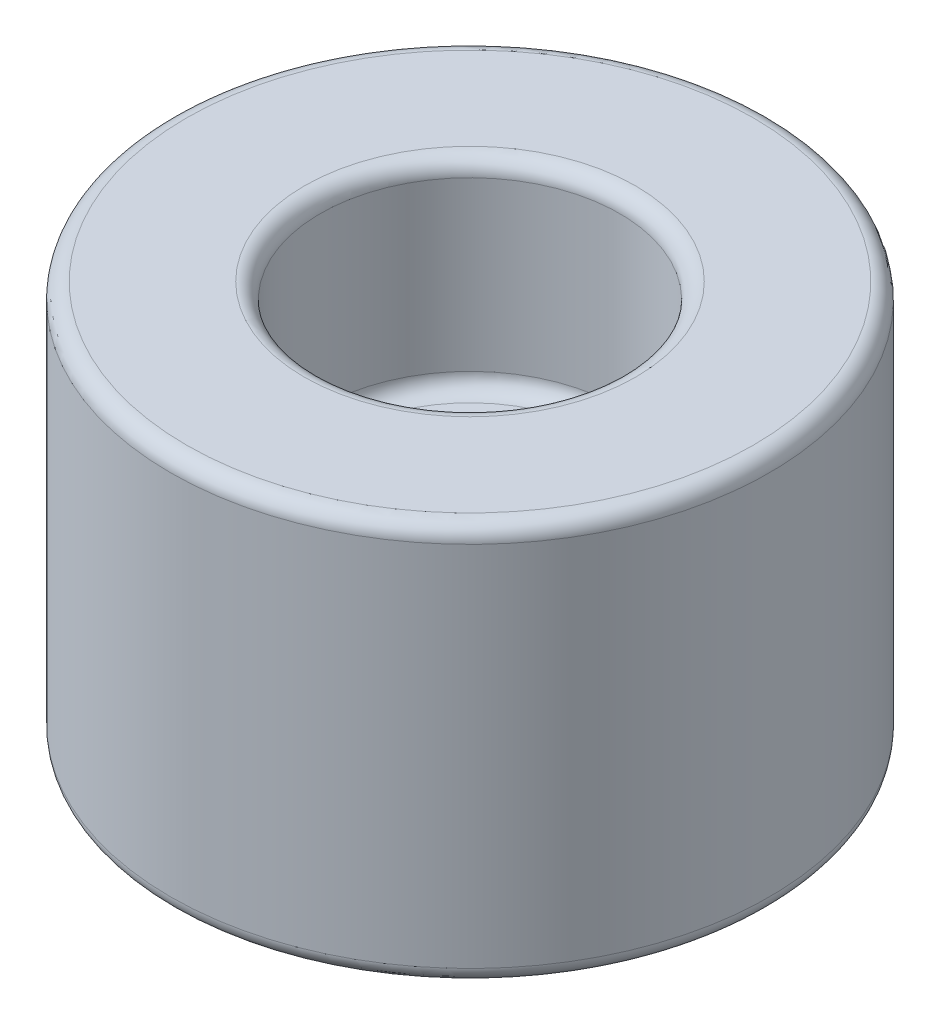
ISO-10303-21;
HEADER;
FILE_DESCRIPTION(('STEP AP214'),'2;1');
FILE_NAME('part.step','',(''),(''),'','','');
FILE_SCHEMA(('AUTOMOTIVE_DESIGN { 1 0 10303 214 1 1 1 1 }'));
ENDSEC;
DATA;
#1=APPLICATION_CONTEXT('core data for automotive mechanical design processes');
#2=APPLICATION_PROTOCOL_DEFINITION('international standard','automotive_design',2000,#1);
#3=PRODUCT_CONTEXT('',#1,'mechanical');
#4=PRODUCT('Part','Part','',(#3));
#5=PRODUCT_RELATED_PRODUCT_CATEGORY('part','',(#4));
#6=PRODUCT_DEFINITION_FORMATION('','',#4);
#7=PRODUCT_DEFINITION_CONTEXT('part definition',#1,'design');
#8=PRODUCT_DEFINITION('design','',#6,#7);
#9=PRODUCT_DEFINITION_SHAPE('','',#8);
#10=(LENGTH_UNIT() NAMED_UNIT(*) SI_UNIT(.MILLI.,.METRE.));
#11=(NAMED_UNIT(*) PLANE_ANGLE_UNIT() SI_UNIT($,.RADIAN.));
#12=(NAMED_UNIT(*) SI_UNIT($,.STERADIAN.) SOLID_ANGLE_UNIT());
#13=UNCERTAINTY_MEASURE_WITH_UNIT(LENGTH_MEASURE(1.E-05),#10,'distance_accuracy_value','');
#14=(GEOMETRIC_REPRESENTATION_CONTEXT(3) GLOBAL_UNCERTAINTY_ASSIGNED_CONTEXT((#13)) GLOBAL_UNIT_ASSIGNED_CONTEXT((#10,
#11,#12)) REPRESENTATION_CONTEXT('',''));
#15=CARTESIAN_POINT('',(0.,0.,0.));
#16=DIRECTION('',(0.,0.,1.));
#17=DIRECTION('',(1.,0.,0.));
#18=AXIS2_PLACEMENT_3D('',#15,#16,#17);
#19=CARTESIAN_POINT('',(0.,0.,0.));
#20=DIRECTION('',(0.,-1.,0.));
#21=DIRECTION('',(0.,0.,-1.00000000000001));
#22=AXIS2_PLACEMENT_3D('',#19,#20,#21);
#23=CYLINDRICAL_SURFACE('',#22,4.7625);
#24=CARTESIAN_POINT('',(0.,6.85800000000034,0.));
#25=DIRECTION('',(0.,1.,0.));
#26=DIRECTION('',(0.,0.,1.00000000000001));
#27=AXIS2_PLACEMENT_3D('',#24,#25,#26);
#28=CIRCLE('',#27,4.7625);
#29=CARTESIAN_POINT('',(0.,6.85800000000035,4.76250000000003));
#30=VERTEX_POINT('',#29);
#31=EDGE_CURVE('E66',#30,#30,#28,.F.);
#32=ORIENTED_EDGE('',*,*,#31,.T.);
#33=EDGE_LOOP('',(#32));
#34=FACE_BOUND('',#33,.T.);
#35=CARTESIAN_POINT('',(0.,12.1920000000003,0.));
#36=DIRECTION('',(0.,1.,0.));
#37=DIRECTION('',(0.,0.,1.00000000000001));
#38=AXIS2_PLACEMENT_3D('',#35,#36,#37);
#39=CIRCLE('',#38,4.7625);
#40=CARTESIAN_POINT('',(0.,12.1920000000003,4.76250000000003));
#41=VERTEX_POINT('',#40);
#42=EDGE_CURVE('E69',#41,#41,#39,.T.);
#43=ORIENTED_EDGE('',*,*,#42,.T.);
#44=EDGE_LOOP('',(#43));
#45=FACE_BOUND('',#44,.T.);
#46=ADVANCED_FACE('F46',(#34,#45),#23,.F.);
#47=CARTESIAN_POINT('',(0.,12.6999999999999,-4.7625));
#48=DIRECTION('',(0.,1.,0.));
#49=DIRECTION('',(0.,0.,1.00000000000001));
#50=AXIS2_PLACEMENT_3D('',#47,#48,#49);
#51=PLANE('',#50);
#52=CARTESIAN_POINT('',(0.,12.7000000000003,0.));
#53=DIRECTION('',(0.,1.,0.));
#54=DIRECTION('',(0.,0.,1.00000000000001));
#55=AXIS2_PLACEMENT_3D('',#52,#53,#54);
#56=CIRCLE('',#55,5.2705);
#57=CARTESIAN_POINT('',(0.,12.7000000000003,5.27050000000003));
#58=VERTEX_POINT('',#57);
#59=EDGE_CURVE('E57',#58,#58,#56,.F.);
#60=ORIENTED_EDGE('',*,*,#59,.T.);
#61=EDGE_LOOP('',(#60));
#62=FACE_BOUND('',#61,.T.);
#63=CARTESIAN_POINT('',(0.,12.7000000000003,0.));
#64=DIRECTION('',(0.,1.,0.));
#65=DIRECTION('',(0.,0.,1.00000000000001));
#66=AXIS2_PLACEMENT_3D('',#63,#64,#65);
#67=CIRCLE('',#66,9.017);
#68=CARTESIAN_POINT('',(0.,12.7000000000003,9.01700000000006));
#69=VERTEX_POINT('',#68);
#70=EDGE_CURVE('E61',#69,#69,#67,.T.);
#71=ORIENTED_EDGE('',*,*,#70,.T.);
#72=EDGE_LOOP('',(#71));
#73=FACE_BOUND('',#72,.T.);
#74=ADVANCED_FACE('F115',(#62,#73),#51,.T.);
#75=CARTESIAN_POINT('',(0.,0.,0.));
#76=DIRECTION('',(0.,-1.,0.));
#77=DIRECTION('',(0.,0.,-1.00000000000001));
#78=AXIS2_PLACEMENT_3D('',#75,#76,#77);
#79=CYLINDRICAL_SURFACE('',#78,9.525);
#80=CARTESIAN_POINT('',(0.,0.507999999999842,0.));
#81=DIRECTION('',(0.,-1.,0.));
#82=DIRECTION('',(0.,0.,-1.00000000000001));
#83=AXIS2_PLACEMENT_3D('',#80,#81,#82);
#84=CIRCLE('',#83,9.525);
#85=CARTESIAN_POINT('',(0.,0.507999999999816,-9.52500000000007));
#86=VERTEX_POINT('',#85);
#87=EDGE_CURVE('E12',#86,#86,#84,.F.);
#88=ORIENTED_EDGE('',*,*,#87,.T.);
#89=EDGE_LOOP('',(#88));
#90=FACE_BOUND('',#89,.T.);
#91=CARTESIAN_POINT('',(0.,12.1920000000003,0.));
#92=DIRECTION('',(0.,1.,0.));
#93=DIRECTION('',(0.,0.,1.00000000000001));
#94=AXIS2_PLACEMENT_3D('',#91,#92,#93);
#95=CIRCLE('',#94,9.525);
#96=CARTESIAN_POINT('',(0.,12.1920000000003,9.52500000000007));
#97=VERTEX_POINT('',#96);
#98=EDGE_CURVE('E53',#97,#97,#95,.F.);
#99=ORIENTED_EDGE('',*,*,#98,.T.);
#100=EDGE_LOOP('',(#99));
#101=FACE_BOUND('',#100,.T.);
#102=ADVANCED_FACE('F127',(#90,#101),#79,.T.);
#103=CARTESIAN_POINT('',(0.,-1.66533453693773E-12,-9.52500000000001));
#104=DIRECTION('',(0.,-1.,0.));
#105=DIRECTION('',(0.,0.,-1.00000000000001));
#106=AXIS2_PLACEMENT_3D('',#103,#104,#105);
#107=PLANE('',#106);
#108=CARTESIAN_POINT('',(0.,0.,0.));
#109=DIRECTION('',(0.,-1.,0.));
#110=DIRECTION('',(0.,0.,-1.00000000000001));
#111=AXIS2_PLACEMENT_3D('',#108,#109,#110);
#112=CIRCLE('',#111,2.2939375);
#113=CARTESIAN_POINT('',(0.,0.,-2.29393750000002));
#114=VERTEX_POINT('',#113);
#115=EDGE_CURVE('E78',#114,#114,#112,.F.);
#116=ORIENTED_EDGE('',*,*,#115,.T.);
#117=EDGE_LOOP('',(#116));
#118=FACE_BOUND('',#117,.T.);
#119=CARTESIAN_POINT('',(0.,0.,0.));
#120=DIRECTION('',(0.,-1.,0.));
#121=DIRECTION('',(0.,0.,-1.00000000000001));
#122=AXIS2_PLACEMENT_3D('',#119,#120,#121);
#123=CIRCLE('',#122,9.017);
#124=CARTESIAN_POINT('',(0.,0.,-9.01700000000006));
#125=VERTEX_POINT('',#124);
#126=EDGE_CURVE('E81',#125,#125,#123,.T.);
#127=ORIENTED_EDGE('',*,*,#126,.T.);
#128=EDGE_LOOP('',(#127));
#129=FACE_BOUND('',#128,.T.);
#130=ADVANCED_FACE('F146',(#118,#129),#107,.T.);
#131=CARTESIAN_POINT('',(0.,0.,0.));
#132=DIRECTION('',(0.,-1.,0.));
#133=DIRECTION('',(0.,0.,-1.00000000000001));
#134=AXIS2_PLACEMENT_3D('',#131,#132,#133);
#135=CYLINDRICAL_SURFACE('',#134,1.7859375);
#136=CARTESIAN_POINT('',(0.,0.507999999999842,0.));
#137=DIRECTION('',(0.,-1.,0.));
#138=DIRECTION('',(0.,0.,-1.00000000000001));
#139=AXIS2_PLACEMENT_3D('',#136,#137,#138);
#140=CIRCLE('',#139,1.7859375);
#141=CARTESIAN_POINT('',(0.,0.507999999999837,-1.78593750000001));
#142=VERTEX_POINT('',#141);
#143=EDGE_CURVE('E84',#142,#142,#140,.T.);
#144=ORIENTED_EDGE('',*,*,#143,.T.);
#145=EDGE_LOOP('',(#144));
#146=FACE_BOUND('',#145,.T.);
#147=CARTESIAN_POINT('',(0.,5.8420000000001,0.));
#148=DIRECTION('',(0.,1.,0.));
#149=DIRECTION('',(0.,0.,1.00000000000001));
#150=AXIS2_PLACEMENT_3D('',#147,#148,#149);
#151=CIRCLE('',#150,1.7859375);
#152=CARTESIAN_POINT('',(0.,5.8420000000001,1.78593750000001));
#153=VERTEX_POINT('',#152);
#154=EDGE_CURVE('E87',#153,#153,#151,.T.);
#155=ORIENTED_EDGE('',*,*,#154,.T.);
#156=EDGE_LOOP('',(#155));
#157=FACE_BOUND('',#156,.T.);
#158=ADVANCED_FACE('F91',(#146,#157),#135,.F.);
#159=CARTESIAN_POINT('',(0.,6.34999999999837,-1.78593750000022));
#160=DIRECTION('',(0.,1.,0.));
#161=DIRECTION('',(0.,0.,1.00000000000001));
#162=AXIS2_PLACEMENT_3D('',#159,#160,#161);
#163=PLANE('',#162);
#164=CARTESIAN_POINT('',(0.,6.35000000000008,0.));
#165=DIRECTION('',(0.,1.,0.));
#166=DIRECTION('',(0.,0.,1.00000000000001));
#167=AXIS2_PLACEMENT_3D('',#164,#165,#166);
#168=CIRCLE('',#167,2.2939375);
#169=CARTESIAN_POINT('',(0.,6.35000000000008,2.29393750000002));
#170=VERTEX_POINT('',#169);
#171=EDGE_CURVE('E72',#170,#170,#168,.F.);
#172=ORIENTED_EDGE('',*,*,#171,.T.);
#173=EDGE_LOOP('',(#172));
#174=FACE_BOUND('',#173,.T.);
#175=CARTESIAN_POINT('',(0.,6.35000000000008,0.));
#176=DIRECTION('',(0.,1.,0.));
#177=DIRECTION('',(0.,0.,1.00000000000001));
#178=AXIS2_PLACEMENT_3D('',#175,#176,#177);
#179=CIRCLE('',#178,4.2545);
#180=CARTESIAN_POINT('',(0.,6.35000000000009,4.25450000000003));
#181=VERTEX_POINT('',#180);
#182=EDGE_CURVE('E75',#181,#181,#179,.T.);
#183=ORIENTED_EDGE('',*,*,#182,.T.);
#184=EDGE_LOOP('',(#183));
#185=FACE_BOUND('',#184,.T.);
#186=ADVANCED_FACE('F101',(#174,#185),#163,.T.);
#187=CARTESIAN_POINT('',(0.,0.507999999999842,0.));
#188=DIRECTION('',(0.,-1.,0.));
#189=DIRECTION('',(0.,0.,-1.00000000000001));
#190=AXIS2_PLACEMENT_3D('',#187,#188,#189);
#191=TOROIDAL_SURFACE('',#190,2.2939375,0.508);
#192=ORIENTED_EDGE('',*,*,#115,.F.);
#193=EDGE_LOOP('',(#192));
#194=FACE_BOUND('',#193,.T.);
#195=ORIENTED_EDGE('',*,*,#143,.F.);
#196=EDGE_LOOP('',(#195));
#197=FACE_BOUND('',#196,.T.);
#198=ADVANCED_FACE('F97',(#194,#197),#191,.T.);
#199=CARTESIAN_POINT('',(0.,5.8420000000001,0.));
#200=DIRECTION('',(0.,1.,0.));
#201=DIRECTION('',(0.,0.,1.00000000000001));
#202=AXIS2_PLACEMENT_3D('',#199,#200,#201);
#203=TOROIDAL_SURFACE('',#202,2.2939375,0.508);
#204=ORIENTED_EDGE('',*,*,#154,.F.);
#205=EDGE_LOOP('',(#204));
#206=FACE_BOUND('',#205,.T.);
#207=ORIENTED_EDGE('',*,*,#171,.F.);
#208=EDGE_LOOP('',(#207));
#209=FACE_BOUND('',#208,.T.);
#210=ADVANCED_FACE('F93',(#206,#209),#203,.T.);
#211=CARTESIAN_POINT('',(0.,6.85800000000034,0.));
#212=DIRECTION('',(0.,1.,0.));
#213=DIRECTION('',(0.,0.,1.00000000000001));
#214=AXIS2_PLACEMENT_3D('',#211,#212,#213);
#215=TOROIDAL_SURFACE('',#214,4.2545,0.508);
#216=ORIENTED_EDGE('',*,*,#182,.F.);
#217=EDGE_LOOP('',(#216));
#218=FACE_BOUND('',#217,.T.);
#219=ORIENTED_EDGE('',*,*,#31,.F.);
#220=EDGE_LOOP('',(#219));
#221=FACE_BOUND('',#220,.T.);
#222=ADVANCED_FACE('F96',(#218,#221),#215,.F.);
#223=CARTESIAN_POINT('',(0.,12.1920000000003,0.));
#224=DIRECTION('',(0.,1.,0.));
#225=DIRECTION('',(0.,0.,1.00000000000001));
#226=AXIS2_PLACEMENT_3D('',#223,#224,#225);
#227=TOROIDAL_SURFACE('',#226,5.2705,0.508);
#228=ORIENTED_EDGE('',*,*,#42,.F.);
#229=EDGE_LOOP('',(#228));
#230=FACE_BOUND('',#229,.T.);
#231=ORIENTED_EDGE('',*,*,#59,.F.);
#232=EDGE_LOOP('',(#231));
#233=FACE_BOUND('',#232,.T.);
#234=ADVANCED_FACE('F109',(#230,#233),#227,.T.);
#235=CARTESIAN_POINT('',(0.,0.507999999999842,0.));
#236=DIRECTION('',(0.,-1.,0.));
#237=DIRECTION('',(0.,0.,-1.00000000000001));
#238=AXIS2_PLACEMENT_3D('',#235,#236,#237);
#239=TOROIDAL_SURFACE('',#238,9.017,0.508);
#240=ORIENTED_EDGE('',*,*,#87,.F.);
#241=EDGE_LOOP('',(#240));
#242=FACE_BOUND('',#241,.T.);
#243=ORIENTED_EDGE('',*,*,#126,.F.);
#244=EDGE_LOOP('',(#243));
#245=FACE_BOUND('',#244,.T.);
#246=ADVANCED_FACE('F121',(#242,#245),#239,.T.);
#247=CARTESIAN_POINT('',(0.,12.1920000000003,0.));
#248=DIRECTION('',(0.,1.,0.));
#249=DIRECTION('',(0.,0.,1.00000000000001));
#250=AXIS2_PLACEMENT_3D('',#247,#248,#249);
#251=TOROIDAL_SURFACE('',#250,9.017,0.508);
#252=ORIENTED_EDGE('',*,*,#70,.F.);
#253=EDGE_LOOP('',(#252));
#254=FACE_BOUND('',#253,.T.);
#255=ORIENTED_EDGE('',*,*,#98,.F.);
#256=EDGE_LOOP('',(#255));
#257=FACE_BOUND('',#256,.T.);
#258=ADVANCED_FACE('F48',(#254,#257),#251,.T.);
#259=CLOSED_SHELL('',(#46,#74,#102,#130,#158,#186,#198,#210,#222,#234,#246,#258));
#260=MANIFOLD_SOLID_BREP('B2',#259);
#261=ADVANCED_BREP_SHAPE_REPRESENTATION('',(#18,#260),#14);
#262=SHAPE_DEFINITION_REPRESENTATION(#9,#261);
ENDSEC;
END-ISO-10303-21;
